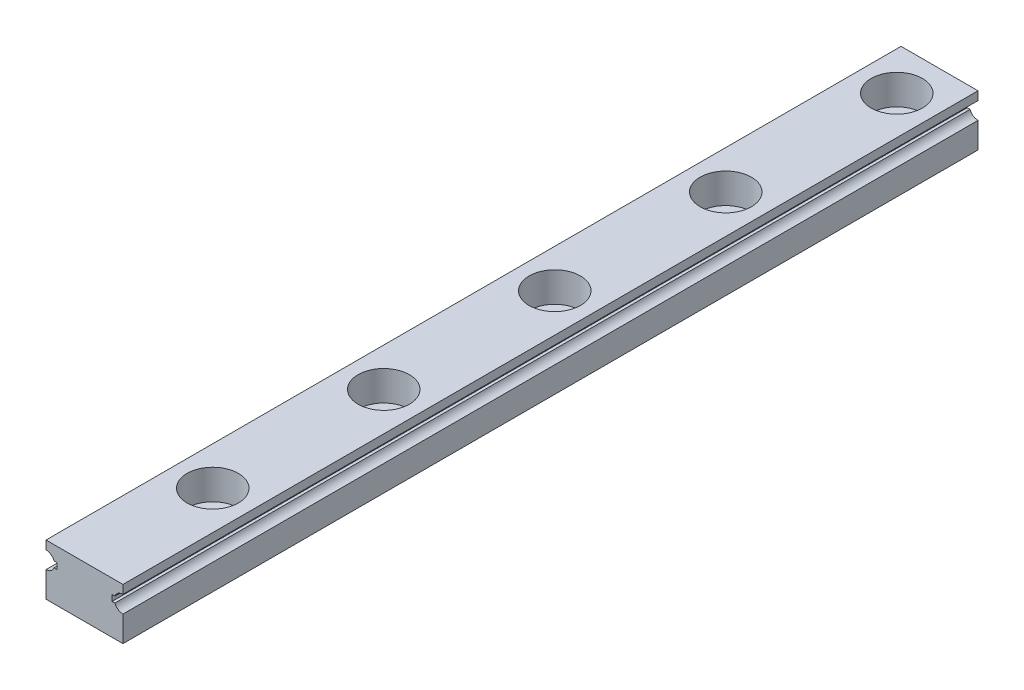
ISO-10303-21;
HEADER;
FILE_DESCRIPTION(('STEP AP214'),'2;1');
FILE_NAME('part.step','',(''),(''),'','','');
FILE_SCHEMA(('AUTOMOTIVE_DESIGN { 1 0 10303 214 1 1 1 1 }'));
ENDSEC;
DATA;
#1=APPLICATION_CONTEXT('core data for automotive mechanical design processes');
#2=APPLICATION_PROTOCOL_DEFINITION('international standard','automotive_design',2000,#1);
#3=PRODUCT_CONTEXT('',#1,'mechanical');
#4=PRODUCT('Part','Part','',(#3));
#5=PRODUCT_RELATED_PRODUCT_CATEGORY('part','',(#4));
#6=PRODUCT_DEFINITION_FORMATION('','',#4);
#7=PRODUCT_DEFINITION_CONTEXT('part definition',#1,'design');
#8=PRODUCT_DEFINITION('design','',#6,#7);
#9=PRODUCT_DEFINITION_SHAPE('','',#8);
#10=(LENGTH_UNIT() NAMED_UNIT(*) SI_UNIT(.MILLI.,.METRE.));
#11=(NAMED_UNIT(*) PLANE_ANGLE_UNIT() SI_UNIT($,.RADIAN.));
#12=(NAMED_UNIT(*) SI_UNIT($,.STERADIAN.) SOLID_ANGLE_UNIT());
#13=UNCERTAINTY_MEASURE_WITH_UNIT(LENGTH_MEASURE(1.E-05),#10,'distance_accuracy_value','');
#14=(GEOMETRIC_REPRESENTATION_CONTEXT(3) GLOBAL_UNCERTAINTY_ASSIGNED_CONTEXT((#13)) GLOBAL_UNIT_ASSIGNED_CONTEXT((#10,
#11,#12)) REPRESENTATION_CONTEXT('',''));
#15=CARTESIAN_POINT('',(0.,0.,0.));
#16=DIRECTION('',(0.,0.,1.));
#17=DIRECTION('',(1.,0.,0.));
#18=AXIS2_PLACEMENT_3D('',#15,#16,#17);
#19=CARTESIAN_POINT('',(4.5,2.,100.));
#20=DIRECTION('',(-1.,0.,0.));
#21=DIRECTION('',(0.,-1.,0.));
#22=AXIS2_PLACEMENT_3D('',#19,#20,#21);
#23=PLANE('',#22);
#24=DIRECTION('',(0.,1.,0.));
#25=VECTOR('',#24,1.);
#26=CARTESIAN_POINT('',(4.5,2.,0.));
#27=LINE('',#26,#25);
#28=CARTESIAN_POINT('',(4.5,2.,0.));
#29=VERTEX_POINT('',#28);
#30=CARTESIAN_POINT('',(4.5,3.,0.));
#31=VERTEX_POINT('',#30);
#32=EDGE_CURVE('E182',#29,#31,#27,.T.);
#33=ORIENTED_EDGE('',*,*,#32,.T.);
#34=DIRECTION('',(0.,0.,-1.));
#35=VECTOR('',#34,1.);
#36=CARTESIAN_POINT('',(4.5,3.,100.));
#37=LINE('',#36,#35);
#38=CARTESIAN_POINT('',(4.5,3.,100.));
#39=VERTEX_POINT('',#38);
#40=EDGE_CURVE('E250',#39,#31,#37,.T.);
#41=ORIENTED_EDGE('',*,*,#40,.F.);
#42=DIRECTION('',(0.,1.,0.));
#43=VECTOR('',#42,1.);
#44=CARTESIAN_POINT('',(4.5,2.,100.));
#45=LINE('',#44,#43);
#46=CARTESIAN_POINT('',(4.5,2.,100.));
#47=VERTEX_POINT('',#46);
#48=EDGE_CURVE('E213',#47,#39,#45,.T.);
#49=ORIENTED_EDGE('',*,*,#48,.F.);
#50=DIRECTION('',(0.,0.,-1.));
#51=VECTOR('',#50,1.);
#52=CARTESIAN_POINT('',(4.5,2.,100.));
#53=LINE('',#52,#51);
#54=EDGE_CURVE('E178',#47,#29,#53,.T.);
#55=ORIENTED_EDGE('',*,*,#54,.T.);
#56=EDGE_LOOP('',(#33,#41,#49,#55));
#57=FACE_BOUND('',#56,.T.);
#58=ADVANCED_FACE('F34',(#57),#23,.F.);
#59=CARTESIAN_POINT('',(-4.5,3.,100.));
#60=DIRECTION('',(0.,-1.,0.));
#61=DIRECTION('',(0.,0.,-1.));
#62=AXIS2_PLACEMENT_3D('',#59,#60,#61);
#63=PLANE('',#62);
#64=CARTESIAN_POINT('',(0.,3.,25.));
#65=DIRECTION('',(0.,1.,0.));
#66=DIRECTION('',(0.,0.,1.));
#67=AXIS2_PLACEMENT_3D('',#64,#65,#66);
#68=CIRCLE('',#67,3.);
#69=CARTESIAN_POINT('',(0.,3.,28.));
#70=VERTEX_POINT('',#69);
#71=EDGE_CURVE('E274',#70,#70,#68,.T.);
#72=ORIENTED_EDGE('',*,*,#71,.F.);
#73=EDGE_LOOP('',(#72));
#74=FACE_BOUND('',#73,.T.);
#75=CARTESIAN_POINT('',(0.,3.,5.));
#76=DIRECTION('',(0.,1.,0.));
#77=DIRECTION('',(0.,0.,1.));
#78=AXIS2_PLACEMENT_3D('',#75,#76,#77);
#79=CIRCLE('',#78,3.);
#80=CARTESIAN_POINT('',(0.,3.,8.));
#81=VERTEX_POINT('',#80);
#82=EDGE_CURVE('E256',#81,#81,#79,.T.);
#83=ORIENTED_EDGE('',*,*,#82,.F.);
#84=EDGE_LOOP('',(#83));
#85=FACE_BOUND('',#84,.T.);
#86=DIRECTION('',(-1.,0.,0.));
#87=VECTOR('',#86,1.);
#88=CARTESIAN_POINT('',(-4.5,3.,0.));
#89=LINE('',#88,#87);
#90=CARTESIAN_POINT('',(-4.5,3.,0.));
#91=VERTEX_POINT('',#90);
#92=EDGE_CURVE('E185',#31,#91,#89,.T.);
#93=ORIENTED_EDGE('',*,*,#92,.T.);
#94=DIRECTION('',(0.,0.,-1.));
#95=VECTOR('',#94,1.);
#96=CARTESIAN_POINT('',(-4.5,3.,100.));
#97=LINE('',#96,#95);
#98=CARTESIAN_POINT('',(-4.5,3.,100.));
#99=VERTEX_POINT('',#98);
#100=EDGE_CURVE('E247',#99,#91,#97,.T.);
#101=ORIENTED_EDGE('',*,*,#100,.F.);
#102=DIRECTION('',(-1.,0.,0.));
#103=VECTOR('',#102,1.);
#104=CARTESIAN_POINT('',(-4.5,3.,100.));
#105=LINE('',#104,#103);
#106=EDGE_CURVE('E121',#39,#99,#105,.T.);
#107=ORIENTED_EDGE('',*,*,#106,.F.);
#108=ORIENTED_EDGE('',*,*,#40,.T.);
#109=EDGE_LOOP('',(#93,#101,#107,#108));
#110=FACE_BOUND('',#109,.T.);
#111=CARTESIAN_POINT('',(0.,3.,45.));
#112=DIRECTION('',(0.,1.,0.));
#113=DIRECTION('',(0.,0.,1.));
#114=AXIS2_PLACEMENT_3D('',#111,#112,#113);
#115=CIRCLE('',#114,3.);
#116=CARTESIAN_POINT('',(0.,3.,48.));
#117=VERTEX_POINT('',#116);
#118=EDGE_CURVE('E252',#117,#117,#115,.T.);
#119=ORIENTED_EDGE('',*,*,#118,.F.);
#120=EDGE_LOOP('',(#119));
#121=FACE_BOUND('',#120,.T.);
#122=CARTESIAN_POINT('',(0.,3.,65.));
#123=DIRECTION('',(0.,1.,0.));
#124=DIRECTION('',(0.,0.,1.));
#125=AXIS2_PLACEMENT_3D('',#122,#123,#124);
#126=CIRCLE('',#125,3.);
#127=CARTESIAN_POINT('',(0.,3.,68.));
#128=VERTEX_POINT('',#127);
#129=EDGE_CURVE('E263',#128,#128,#126,.T.);
#130=ORIENTED_EDGE('',*,*,#129,.F.);
#131=EDGE_LOOP('',(#130));
#132=FACE_BOUND('',#131,.T.);
#133=CARTESIAN_POINT('',(0.,3.,85.));
#134=DIRECTION('',(0.,1.,0.));
#135=DIRECTION('',(0.,0.,1.));
#136=AXIS2_PLACEMENT_3D('',#133,#134,#135);
#137=CIRCLE('',#136,3.);
#138=CARTESIAN_POINT('',(0.,3.,88.));
#139=VERTEX_POINT('',#138);
#140=EDGE_CURVE('E44',#139,#139,#137,.T.);
#141=ORIENTED_EDGE('',*,*,#140,.F.);
#142=EDGE_LOOP('',(#141));
#143=FACE_BOUND('',#142,.T.);
#144=ADVANCED_FACE('F356',(#74,#85,#110,#121,#132,#143),#63,.F.);
#145=CARTESIAN_POINT('',(-4.5,2.,100.));
#146=DIRECTION('',(1.,0.,0.));
#147=DIRECTION('',(0.,1.,0.));
#148=AXIS2_PLACEMENT_3D('',#145,#146,#147);
#149=PLANE('',#148);
#150=DIRECTION('',(0.,-1.,0.));
#151=VECTOR('',#150,1.);
#152=CARTESIAN_POINT('',(-4.5,2.,0.));
#153=LINE('',#152,#151);
#154=CARTESIAN_POINT('',(-4.5,2.,0.));
#155=VERTEX_POINT('',#154);
#156=EDGE_CURVE('E188',#91,#155,#153,.T.);
#157=ORIENTED_EDGE('',*,*,#156,.T.);
#158=DIRECTION('',(0.,0.,-1.));
#159=VECTOR('',#158,1.);
#160=CARTESIAN_POINT('',(-4.5,2.,100.));
#161=LINE('',#160,#159);
#162=CARTESIAN_POINT('',(-4.5,2.,100.));
#163=VERTEX_POINT('',#162);
#164=EDGE_CURVE('E244',#163,#155,#161,.T.);
#165=ORIENTED_EDGE('',*,*,#164,.F.);
#166=DIRECTION('',(0.,-1.,0.));
#167=VECTOR('',#166,1.);
#168=CARTESIAN_POINT('',(-4.5,2.,100.));
#169=LINE('',#168,#167);
#170=EDGE_CURVE('E309',#99,#163,#169,.T.);
#171=ORIENTED_EDGE('',*,*,#170,.F.);
#172=ORIENTED_EDGE('',*,*,#100,.T.);
#173=EDGE_LOOP('',(#157,#165,#171,#172));
#174=FACE_BOUND('',#173,.T.);
#175=ADVANCED_FACE('F361',(#174),#149,.F.);
#176=CARTESIAN_POINT('',(-4.5,1.,100.));
#177=DIRECTION('',(0.,0.,-1.));
#178=DIRECTION('',(-1.,0.,0.));
#179=AXIS2_PLACEMENT_3D('',#176,#177,#178);
#180=CYLINDRICAL_SURFACE('',#179,1.);
#181=CARTESIAN_POINT('',(-4.5,1.,0.));
#182=DIRECTION('',(0.,0.,-1.));
#183=DIRECTION('',(1.,0.,0.));
#184=AXIS2_PLACEMENT_3D('',#181,#182,#183);
#185=CIRCLE('',#184,1.);
#186=CARTESIAN_POINT('',(-3.56399113733362,1.35197643246386,0.));
#187=VERTEX_POINT('',#186);
#188=EDGE_CURVE('E190',#155,#187,#185,.T.);
#189=ORIENTED_EDGE('',*,*,#188,.T.);
#190=DIRECTION('',(0.,0.,-1.));
#191=VECTOR('',#190,1.);
#192=CARTESIAN_POINT('',(-3.56399113733362,1.35197643246386,100.));
#193=LINE('',#192,#191);
#194=CARTESIAN_POINT('',(-3.56399113733362,1.35197643246386,100.));
#195=VERTEX_POINT('',#194);
#196=EDGE_CURVE('E241',#195,#187,#193,.T.);
#197=ORIENTED_EDGE('',*,*,#196,.F.);
#198=CARTESIAN_POINT('',(-4.5,1.,100.));
#199=DIRECTION('',(0.,0.,-1.));
#200=DIRECTION('',(1.,0.,0.));
#201=AXIS2_PLACEMENT_3D('',#198,#199,#200);
#202=CIRCLE('',#201,1.);
#203=EDGE_CURVE('E311',#163,#195,#202,.T.);
#204=ORIENTED_EDGE('',*,*,#203,.F.);
#205=ORIENTED_EDGE('',*,*,#164,.T.);
#206=EDGE_LOOP('',(#189,#197,#204,#205));
#207=FACE_BOUND('',#206,.T.);
#208=ADVANCED_FACE('F456',(#207),#180,.F.);
#209=CARTESIAN_POINT('',(-3.56399113733362,1.35197643246386,100.));
#210=DIRECTION('',(0.,1.,0.));
#211=DIRECTION('',(0.,0.,1.));
#212=AXIS2_PLACEMENT_3D('',#209,#210,#211);
#213=PLANE('',#212);
#214=DIRECTION('',(1.,0.,0.));
#215=VECTOR('',#214,1.);
#216=CARTESIAN_POINT('',(-3.56399113733362,1.35197643246386,0.));
#217=LINE('',#216,#215);
#218=CARTESIAN_POINT('',(-3.23507302495561,1.35197643246386,0.));
#219=VERTEX_POINT('',#218);
#220=EDGE_CURVE('E192',#187,#219,#217,.T.);
#221=ORIENTED_EDGE('',*,*,#220,.T.);
#222=DIRECTION('',(0.,0.,-1.));
#223=VECTOR('',#222,1.);
#224=CARTESIAN_POINT('',(-3.23507302495561,1.35197643246386,100.));
#225=LINE('',#224,#223);
#226=CARTESIAN_POINT('',(-3.23507302495561,1.35197643246386,100.));
#227=VERTEX_POINT('',#226);
#228=EDGE_CURVE('E238',#227,#219,#225,.T.);
#229=ORIENTED_EDGE('',*,*,#228,.F.);
#230=DIRECTION('',(1.,0.,0.));
#231=VECTOR('',#230,1.);
#232=CARTESIAN_POINT('',(-3.56399113733362,1.35197643246386,100.));
#233=LINE('',#232,#231);
#234=EDGE_CURVE('E313',#195,#227,#233,.T.);
#235=ORIENTED_EDGE('',*,*,#234,.F.);
#236=ORIENTED_EDGE('',*,*,#196,.T.);
#237=EDGE_LOOP('',(#221,#229,#235,#236));
#238=FACE_BOUND('',#237,.T.);
#239=ADVANCED_FACE('F452',(#238),#213,.F.);
#240=CARTESIAN_POINT('',(-3.23507302495561,0.648023567536147,100.));
#241=DIRECTION('',(1.,0.,0.));
#242=DIRECTION('',(0.,0.,-1.));
#243=AXIS2_PLACEMENT_3D('',#240,#241,#242);
#244=PLANE('',#243);
#245=DIRECTION('',(0.,-1.,0.));
#246=VECTOR('',#245,1.);
#247=CARTESIAN_POINT('',(-3.23507302495561,0.648023567536147,0.));
#248=LINE('',#247,#246);
#249=CARTESIAN_POINT('',(-3.23507302495561,0.648023567536147,0.));
#250=VERTEX_POINT('',#249);
#251=EDGE_CURVE('E194',#219,#250,#248,.T.);
#252=ORIENTED_EDGE('',*,*,#251,.T.);
#253=DIRECTION('',(0.,0.,-1.));
#254=VECTOR('',#253,1.);
#255=CARTESIAN_POINT('',(-3.23507302495561,0.648023567536147,100.));
#256=LINE('',#255,#254);
#257=CARTESIAN_POINT('',(-3.23507302495561,0.648023567536147,100.));
#258=VERTEX_POINT('',#257);
#259=EDGE_CURVE('E235',#258,#250,#256,.T.);
#260=ORIENTED_EDGE('',*,*,#259,.F.);
#261=DIRECTION('',(0.,-1.,0.));
#262=VECTOR('',#261,1.);
#263=CARTESIAN_POINT('',(-3.23507302495561,0.648023567536147,100.));
#264=LINE('',#263,#262);
#265=EDGE_CURVE('E315',#227,#258,#264,.T.);
#266=ORIENTED_EDGE('',*,*,#265,.F.);
#267=ORIENTED_EDGE('',*,*,#228,.T.);
#268=EDGE_LOOP('',(#252,#260,#266,#267));
#269=FACE_BOUND('',#268,.T.);
#270=ADVANCED_FACE('F448',(#269),#244,.F.);
#271=CARTESIAN_POINT('',(-3.56399113733362,0.648023567536147,100.));
#272=DIRECTION('',(0.,-1.,0.));
#273=DIRECTION('',(0.,0.,-1.));
#274=AXIS2_PLACEMENT_3D('',#271,#272,#273);
#275=PLANE('',#274);
#276=DIRECTION('',(-1.,0.,0.));
#277=VECTOR('',#276,1.);
#278=CARTESIAN_POINT('',(-3.56399113733362,0.648023567536147,0.));
#279=LINE('',#278,#277);
#280=CARTESIAN_POINT('',(-3.56399113733362,0.648023567536147,0.));
#281=VERTEX_POINT('',#280);
#282=EDGE_CURVE('E196',#250,#281,#279,.T.);
#283=ORIENTED_EDGE('',*,*,#282,.T.);
#284=DIRECTION('',(0.,0.,-1.));
#285=VECTOR('',#284,1.);
#286=CARTESIAN_POINT('',(-3.56399113733362,0.648023567536147,100.));
#287=LINE('',#286,#285);
#288=CARTESIAN_POINT('',(-3.56399113733362,0.648023567536147,100.));
#289=VERTEX_POINT('',#288);
#290=EDGE_CURVE('E232',#289,#281,#287,.T.);
#291=ORIENTED_EDGE('',*,*,#290,.F.);
#292=DIRECTION('',(-1.,0.,0.));
#293=VECTOR('',#292,1.);
#294=CARTESIAN_POINT('',(-3.56399113733362,0.648023567536147,100.));
#295=LINE('',#294,#293);
#296=EDGE_CURVE('E317',#258,#289,#295,.T.);
#297=ORIENTED_EDGE('',*,*,#296,.F.);
#298=ORIENTED_EDGE('',*,*,#259,.T.);
#299=EDGE_LOOP('',(#283,#291,#297,#298));
#300=FACE_BOUND('',#299,.T.);
#301=ADVANCED_FACE('F444',(#300),#275,.F.);
#302=CARTESIAN_POINT('',(-4.5,1.,100.));
#303=DIRECTION('',(0.,0.,-1.));
#304=DIRECTION('',(-1.,0.,0.));
#305=AXIS2_PLACEMENT_3D('',#302,#303,#304);
#306=CYLINDRICAL_SURFACE('',#305,1.);
#307=CARTESIAN_POINT('',(-4.5,1.,0.));
#308=DIRECTION('',(0.,0.,-1.));
#309=DIRECTION('',(1.,0.,0.));
#310=AXIS2_PLACEMENT_3D('',#307,#308,#309);
#311=CIRCLE('',#310,1.);
#312=CARTESIAN_POINT('',(-4.5,0.,0.));
#313=VERTEX_POINT('',#312);
#314=EDGE_CURVE('E198',#281,#313,#311,.T.);
#315=ORIENTED_EDGE('',*,*,#314,.T.);
#316=DIRECTION('',(0.,0.,-1.));
#317=VECTOR('',#316,1.);
#318=CARTESIAN_POINT('',(-4.5,0.,100.));
#319=LINE('',#318,#317);
#320=CARTESIAN_POINT('',(-4.5,0.,100.));
#321=VERTEX_POINT('',#320);
#322=EDGE_CURVE('E229',#321,#313,#319,.T.);
#323=ORIENTED_EDGE('',*,*,#322,.F.);
#324=CARTESIAN_POINT('',(-4.5,1.,100.));
#325=DIRECTION('',(0.,0.,-1.));
#326=DIRECTION('',(1.,0.,0.));
#327=AXIS2_PLACEMENT_3D('',#324,#325,#326);
#328=CIRCLE('',#327,1.);
#329=EDGE_CURVE('E319',#289,#321,#328,.T.);
#330=ORIENTED_EDGE('',*,*,#329,.F.);
#331=ORIENTED_EDGE('',*,*,#290,.T.);
#332=EDGE_LOOP('',(#315,#323,#330,#331));
#333=FACE_BOUND('',#332,.T.);
#334=ADVANCED_FACE('F440',(#333),#306,.F.);
#335=CARTESIAN_POINT('',(-4.5,-3.,100.));
#336=DIRECTION('',(1.,0.,0.));
#337=DIRECTION('',(0.,0.,-1.));
#338=AXIS2_PLACEMENT_3D('',#335,#336,#337);
#339=PLANE('',#338);
#340=DIRECTION('',(0.,-1.,0.));
#341=VECTOR('',#340,1.);
#342=CARTESIAN_POINT('',(-4.5,-3.,0.));
#343=LINE('',#342,#341);
#344=CARTESIAN_POINT('',(-4.5,-3.,0.));
#345=VERTEX_POINT('',#344);
#346=EDGE_CURVE('E200',#313,#345,#343,.T.);
#347=ORIENTED_EDGE('',*,*,#346,.T.);
#348=DIRECTION('',(0.,0.,-1.));
#349=VECTOR('',#348,1.);
#350=CARTESIAN_POINT('',(-4.5,-3.,100.));
#351=LINE('',#350,#349);
#352=CARTESIAN_POINT('',(-4.5,-3.,100.));
#353=VERTEX_POINT('',#352);
#354=EDGE_CURVE('E226',#353,#345,#351,.T.);
#355=ORIENTED_EDGE('',*,*,#354,.F.);
#356=DIRECTION('',(0.,-1.,0.));
#357=VECTOR('',#356,1.);
#358=CARTESIAN_POINT('',(-4.5,-3.,100.));
#359=LINE('',#358,#357);
#360=EDGE_CURVE('E321',#321,#353,#359,.T.);
#361=ORIENTED_EDGE('',*,*,#360,.F.);
#362=ORIENTED_EDGE('',*,*,#322,.T.);
#363=EDGE_LOOP('',(#347,#355,#361,#362));
#364=FACE_BOUND('',#363,.T.);
#365=ADVANCED_FACE('F414',(#364),#339,.F.);
#366=CARTESIAN_POINT('',(-4.5,-3.,100.));
#367=DIRECTION('',(0.,1.,0.));
#368=DIRECTION('',(-1.,0.,0.));
#369=AXIS2_PLACEMENT_3D('',#366,#367,#368);
#370=PLANE('',#369);
#371=CARTESIAN_POINT('',(0.,-3.,85.));
#372=DIRECTION('',(0.,1.,0.));
#373=DIRECTION('',(0.,0.,1.));
#374=AXIS2_PLACEMENT_3D('',#371,#372,#373);
#375=CIRCLE('',#374,1.75);
#376=CARTESIAN_POINT('',(0.,-3.,86.75));
#377=VERTEX_POINT('',#376);
#378=EDGE_CURVE('E291',#377,#377,#375,.T.);
#379=ORIENTED_EDGE('',*,*,#378,.T.);
#380=EDGE_LOOP('',(#379));
#381=FACE_BOUND('',#380,.T.);
#382=CARTESIAN_POINT('',(0.,-3.,65.));
#383=DIRECTION('',(0.,1.,0.));
#384=DIRECTION('',(0.,0.,1.));
#385=AXIS2_PLACEMENT_3D('',#382,#383,#384);
#386=CIRCLE('',#385,1.75);
#387=CARTESIAN_POINT('',(0.,-3.,66.75));
#388=VERTEX_POINT('',#387);
#389=EDGE_CURVE('E281',#388,#388,#386,.T.);
#390=ORIENTED_EDGE('',*,*,#389,.T.);
#391=EDGE_LOOP('',(#390));
#392=FACE_BOUND('',#391,.T.);
#393=CARTESIAN_POINT('',(0.,-3.,45.));
#394=DIRECTION('',(0.,1.,0.));
#395=DIRECTION('',(0.,0.,1.));
#396=AXIS2_PLACEMENT_3D('',#393,#394,#395);
#397=CIRCLE('',#396,1.75);
#398=CARTESIAN_POINT('',(0.,-3.,46.75));
#399=VERTEX_POINT('',#398);
#400=EDGE_CURVE('E278',#399,#399,#397,.T.);
#401=ORIENTED_EDGE('',*,*,#400,.T.);
#402=EDGE_LOOP('',(#401));
#403=FACE_BOUND('',#402,.T.);
#404=CARTESIAN_POINT('',(0.,-3.,25.));
#405=DIRECTION('',(0.,1.,0.));
#406=DIRECTION('',(0.,0.,1.));
#407=AXIS2_PLACEMENT_3D('',#404,#405,#406);
#408=CIRCLE('',#407,1.75);
#409=CARTESIAN_POINT('',(0.,-3.,26.75));
#410=VERTEX_POINT('',#409);
#411=EDGE_CURVE('E275',#410,#410,#408,.T.);
#412=ORIENTED_EDGE('',*,*,#411,.T.);
#413=EDGE_LOOP('',(#412));
#414=FACE_BOUND('',#413,.T.);
#415=CARTESIAN_POINT('',(0.,-3.,5.));
#416=DIRECTION('',(0.,1.,0.));
#417=DIRECTION('',(0.,0.,1.));
#418=AXIS2_PLACEMENT_3D('',#415,#416,#417);
#419=CIRCLE('',#418,1.75);
#420=CARTESIAN_POINT('',(0.,-3.,6.75));
#421=VERTEX_POINT('',#420);
#422=EDGE_CURVE('E257',#421,#421,#419,.T.);
#423=ORIENTED_EDGE('',*,*,#422,.T.);
#424=EDGE_LOOP('',(#423));
#425=FACE_BOUND('',#424,.T.);
#426=DIRECTION('',(1.,0.,0.));
#427=VECTOR('',#426,1.);
#428=CARTESIAN_POINT('',(-4.5,-3.,0.));
#429=LINE('',#428,#427);
#430=CARTESIAN_POINT('',(4.5,-3.,0.));
#431=VERTEX_POINT('',#430);
#432=EDGE_CURVE('E202',#345,#431,#429,.T.);
#433=ORIENTED_EDGE('',*,*,#432,.T.);
#434=DIRECTION('',(0.,0.,-1.));
#435=VECTOR('',#434,1.);
#436=CARTESIAN_POINT('',(4.5,-3.,100.));
#437=LINE('',#436,#435);
#438=CARTESIAN_POINT('',(4.5,-3.,100.));
#439=VERTEX_POINT('',#438);
#440=EDGE_CURVE('E223',#439,#431,#437,.T.);
#441=ORIENTED_EDGE('',*,*,#440,.F.);
#442=DIRECTION('',(1.,0.,0.));
#443=VECTOR('',#442,1.);
#444=CARTESIAN_POINT('',(-4.5,-3.,100.));
#445=LINE('',#444,#443);
#446=EDGE_CURVE('E323',#353,#439,#445,.T.);
#447=ORIENTED_EDGE('',*,*,#446,.F.);
#448=ORIENTED_EDGE('',*,*,#354,.T.);
#449=EDGE_LOOP('',(#433,#441,#447,#448));
#450=FACE_BOUND('',#449,.T.);
#451=ADVANCED_FACE('F411',(#381,#392,#403,#414,#425,#450),#370,.F.);
#452=CARTESIAN_POINT('',(4.5,-3.,100.));
#453=DIRECTION('',(-1.,0.,0.));
#454=DIRECTION('',(0.,-1.,0.));
#455=AXIS2_PLACEMENT_3D('',#452,#453,#454);
#456=PLANE('',#455);
#457=DIRECTION('',(0.,1.,0.));
#458=VECTOR('',#457,1.);
#459=CARTESIAN_POINT('',(4.5,-3.,0.));
#460=LINE('',#459,#458);
#461=CARTESIAN_POINT('',(4.5,0.,0.));
#462=VERTEX_POINT('',#461);
#463=EDGE_CURVE('E204',#431,#462,#460,.T.);
#464=ORIENTED_EDGE('',*,*,#463,.T.);
#465=DIRECTION('',(0.,0.,-1.));
#466=VECTOR('',#465,1.);
#467=CARTESIAN_POINT('',(4.5,0.,100.));
#468=LINE('',#467,#466);
#469=CARTESIAN_POINT('',(4.5,0.,100.));
#470=VERTEX_POINT('',#469);
#471=EDGE_CURVE('E220',#470,#462,#468,.T.);
#472=ORIENTED_EDGE('',*,*,#471,.F.);
#473=DIRECTION('',(0.,1.,0.));
#474=VECTOR('',#473,1.);
#475=CARTESIAN_POINT('',(4.5,-3.,100.));
#476=LINE('',#475,#474);
#477=EDGE_CURVE('E325',#439,#470,#476,.T.);
#478=ORIENTED_EDGE('',*,*,#477,.F.);
#479=ORIENTED_EDGE('',*,*,#440,.T.);
#480=EDGE_LOOP('',(#464,#472,#478,#479));
#481=FACE_BOUND('',#480,.T.);
#482=ADVANCED_FACE('F413',(#481),#456,.F.);
#483=CARTESIAN_POINT('',(4.5,1.,100.));
#484=DIRECTION('',(0.,0.,-1.));
#485=DIRECTION('',(-1.,0.,0.));
#486=AXIS2_PLACEMENT_3D('',#483,#484,#485);
#487=CYLINDRICAL_SURFACE('',#486,1.);
#488=CARTESIAN_POINT('',(4.5,1.,0.));
#489=DIRECTION('',(0.,0.,-1.));
#490=DIRECTION('',(-1.,0.,0.));
#491=AXIS2_PLACEMENT_3D('',#488,#489,#490);
#492=CIRCLE('',#491,1.);
#493=CARTESIAN_POINT('',(3.56399113733362,0.648023567536147,0.));
#494=VERTEX_POINT('',#493);
#495=EDGE_CURVE('E206',#462,#494,#492,.T.);
#496=ORIENTED_EDGE('',*,*,#495,.T.);
#497=DIRECTION('',(0.,0.,-1.));
#498=VECTOR('',#497,1.);
#499=CARTESIAN_POINT('',(3.56399113733362,0.648023567536147,100.));
#500=LINE('',#499,#498);
#501=CARTESIAN_POINT('',(3.56399113733362,0.648023567536147,100.));
#502=VERTEX_POINT('',#501);
#503=EDGE_CURVE('E217',#502,#494,#500,.T.);
#504=ORIENTED_EDGE('',*,*,#503,.F.);
#505=CARTESIAN_POINT('',(4.5,1.,100.));
#506=DIRECTION('',(0.,0.,-1.));
#507=DIRECTION('',(-1.,0.,0.));
#508=AXIS2_PLACEMENT_3D('',#505,#506,#507);
#509=CIRCLE('',#508,1.);
#510=EDGE_CURVE('E327',#470,#502,#509,.T.);
#511=ORIENTED_EDGE('',*,*,#510,.F.);
#512=ORIENTED_EDGE('',*,*,#471,.T.);
#513=EDGE_LOOP('',(#496,#504,#511,#512));
#514=FACE_BOUND('',#513,.T.);
#515=ADVANCED_FACE('F333',(#514),#487,.F.);
#516=CARTESIAN_POINT('',(3.56399113733362,0.648023567536147,100.));
#517=DIRECTION('',(0.,-1.,0.));
#518=DIRECTION('',(0.,0.,-1.));
#519=AXIS2_PLACEMENT_3D('',#516,#517,#518);
#520=PLANE('',#519);
#521=DIRECTION('',(-1.,0.,0.));
#522=VECTOR('',#521,1.);
#523=CARTESIAN_POINT('',(3.56399113733362,0.648023567536147,0.));
#524=LINE('',#523,#522);
#525=CARTESIAN_POINT('',(3.23507302495561,0.648023567536147,0.));
#526=VERTEX_POINT('',#525);
#527=EDGE_CURVE('E208',#494,#526,#524,.T.);
#528=ORIENTED_EDGE('',*,*,#527,.T.);
#529=DIRECTION('',(0.,0.,-1.));
#530=VECTOR('',#529,1.);
#531=CARTESIAN_POINT('',(3.23507302495561,0.648023567536147,100.));
#532=LINE('',#531,#530);
#533=CARTESIAN_POINT('',(3.23507302495561,0.648023567536147,100.));
#534=VERTEX_POINT('',#533);
#535=EDGE_CURVE('E173',#534,#526,#532,.T.);
#536=ORIENTED_EDGE('',*,*,#535,.F.);
#537=DIRECTION('',(-1.,0.,0.));
#538=VECTOR('',#537,1.);
#539=CARTESIAN_POINT('',(3.56399113733362,0.648023567536147,100.));
#540=LINE('',#539,#538);
#541=EDGE_CURVE('E164',#502,#534,#540,.T.);
#542=ORIENTED_EDGE('',*,*,#541,.F.);
#543=ORIENTED_EDGE('',*,*,#503,.T.);
#544=EDGE_LOOP('',(#528,#536,#542,#543));
#545=FACE_BOUND('',#544,.T.);
#546=ADVANCED_FACE('F337',(#545),#520,.F.);
#547=CARTESIAN_POINT('',(3.23507302495561,0.648023567536147,100.));
#548=DIRECTION('',(-1.,0.,0.));
#549=DIRECTION('',(0.,0.,1.));
#550=AXIS2_PLACEMENT_3D('',#547,#548,#549);
#551=PLANE('',#550);
#552=DIRECTION('',(0.,1.,0.));
#553=VECTOR('',#552,1.);
#554=CARTESIAN_POINT('',(3.23507302495561,0.648023567536147,0.));
#555=LINE('',#554,#553);
#556=CARTESIAN_POINT('',(3.23507302495561,1.35197643246386,0.));
#557=VERTEX_POINT('',#556);
#558=EDGE_CURVE('E172',#526,#557,#555,.T.);
#559=ORIENTED_EDGE('',*,*,#558,.T.);
#560=DIRECTION('',(0.,0.,-1.));
#561=VECTOR('',#560,1.);
#562=CARTESIAN_POINT('',(3.23507302495561,1.35197643246386,100.));
#563=LINE('',#562,#561);
#564=CARTESIAN_POINT('',(3.23507302495561,1.35197643246386,100.));
#565=VERTEX_POINT('',#564);
#566=EDGE_CURVE('E169',#565,#557,#563,.T.);
#567=ORIENTED_EDGE('',*,*,#566,.F.);
#568=DIRECTION('',(0.,1.,0.));
#569=VECTOR('',#568,1.);
#570=CARTESIAN_POINT('',(3.23507302495561,0.648023567536147,100.));
#571=LINE('',#570,#569);
#572=EDGE_CURVE('E158',#534,#565,#571,.T.);
#573=ORIENTED_EDGE('',*,*,#572,.F.);
#574=ORIENTED_EDGE('',*,*,#535,.T.);
#575=EDGE_LOOP('',(#559,#567,#573,#574));
#576=FACE_BOUND('',#575,.T.);
#577=ADVANCED_FACE('F170',(#576),#551,.F.);
#578=CARTESIAN_POINT('',(3.56399113733362,1.35197643246386,100.));
#579=DIRECTION('',(0.,1.,0.));
#580=DIRECTION('',(0.,0.,1.));
#581=AXIS2_PLACEMENT_3D('',#578,#579,#580);
#582=PLANE('',#581);
#583=DIRECTION('',(1.,0.,0.));
#584=VECTOR('',#583,1.);
#585=CARTESIAN_POINT('',(3.56399113733362,1.35197643246386,0.));
#586=LINE('',#585,#584);
#587=CARTESIAN_POINT('',(3.56399113733362,1.35197643246386,0.));
#588=VERTEX_POINT('',#587);
#589=EDGE_CURVE('E106',#557,#588,#586,.T.);
#590=ORIENTED_EDGE('',*,*,#589,.T.);
#591=DIRECTION('',(0.,0.,-1.));
#592=VECTOR('',#591,1.);
#593=CARTESIAN_POINT('',(3.56399113733362,1.35197643246386,100.));
#594=LINE('',#593,#592);
#595=CARTESIAN_POINT('',(3.56399113733362,1.35197643246386,100.));
#596=VERTEX_POINT('',#595);
#597=EDGE_CURVE('E174',#596,#588,#594,.T.);
#598=ORIENTED_EDGE('',*,*,#597,.F.);
#599=DIRECTION('',(1.,0.,0.));
#600=VECTOR('',#599,1.);
#601=CARTESIAN_POINT('',(3.56399113733362,1.35197643246386,100.));
#602=LINE('',#601,#600);
#603=EDGE_CURVE('E162',#565,#596,#602,.T.);
#604=ORIENTED_EDGE('',*,*,#603,.F.);
#605=ORIENTED_EDGE('',*,*,#566,.T.);
#606=EDGE_LOOP('',(#590,#598,#604,#605));
#607=FACE_BOUND('',#606,.T.);
#608=ADVANCED_FACE('F176',(#607),#582,.F.);
#609=CARTESIAN_POINT('',(4.5,1.,100.));
#610=DIRECTION('',(0.,0.,-1.));
#611=DIRECTION('',(-1.,0.,0.));
#612=AXIS2_PLACEMENT_3D('',#609,#610,#611);
#613=CYLINDRICAL_SURFACE('',#612,1.);
#614=CARTESIAN_POINT('',(4.5,1.,0.));
#615=DIRECTION('',(0.,0.,-1.));
#616=DIRECTION('',(-1.,0.,0.));
#617=AXIS2_PLACEMENT_3D('',#614,#615,#616);
#618=CIRCLE('',#617,1.);
#619=EDGE_CURVE('E112',#588,#29,#618,.T.);
#620=ORIENTED_EDGE('',*,*,#619,.T.);
#621=ORIENTED_EDGE('',*,*,#54,.F.);
#622=CARTESIAN_POINT('',(4.5,1.,100.));
#623=DIRECTION('',(0.,0.,-1.));
#624=DIRECTION('',(-1.,0.,0.));
#625=AXIS2_PLACEMENT_3D('',#622,#623,#624);
#626=CIRCLE('',#625,1.);
#627=EDGE_CURVE('E53',#596,#47,#626,.T.);
#628=ORIENTED_EDGE('',*,*,#627,.F.);
#629=ORIENTED_EDGE('',*,*,#597,.T.);
#630=EDGE_LOOP('',(#620,#621,#628,#629));
#631=FACE_BOUND('',#630,.T.);
#632=ADVANCED_FACE('F345',(#631),#613,.F.);
#633=CARTESIAN_POINT('',(-4.5,1.,100.));
#634=DIRECTION('',(0.,0.,1.));
#635=DIRECTION('',(1.,0.,0.));
#636=AXIS2_PLACEMENT_3D('',#633,#634,#635);
#637=PLANE('',#636);
#638=ORIENTED_EDGE('',*,*,#48,.T.);
#639=ORIENTED_EDGE('',*,*,#106,.T.);
#640=ORIENTED_EDGE('',*,*,#170,.T.);
#641=ORIENTED_EDGE('',*,*,#203,.T.);
#642=ORIENTED_EDGE('',*,*,#234,.T.);
#643=ORIENTED_EDGE('',*,*,#265,.T.);
#644=ORIENTED_EDGE('',*,*,#296,.T.);
#645=ORIENTED_EDGE('',*,*,#329,.T.);
#646=ORIENTED_EDGE('',*,*,#360,.T.);
#647=ORIENTED_EDGE('',*,*,#446,.T.);
#648=ORIENTED_EDGE('',*,*,#477,.T.);
#649=ORIENTED_EDGE('',*,*,#510,.T.);
#650=ORIENTED_EDGE('',*,*,#541,.T.);
#651=ORIENTED_EDGE('',*,*,#572,.T.);
#652=ORIENTED_EDGE('',*,*,#603,.T.);
#653=ORIENTED_EDGE('',*,*,#627,.T.);
#654=EDGE_LOOP('',(#638,#639,#640,#641,#642,#643,#644,#645,#646,#647,#648,#649,#650,#651,#652,#653));
#655=FACE_BOUND('',#654,.T.);
#656=ADVANCED_FACE('F160',(#655),#637,.T.);
#657=CARTESIAN_POINT('',(-4.5,1.,0.));
#658=DIRECTION('',(0.,0.,1.));
#659=DIRECTION('',(1.,0.,0.));
#660=AXIS2_PLACEMENT_3D('',#657,#658,#659);
#661=PLANE('',#660);
#662=ORIENTED_EDGE('',*,*,#32,.F.);
#663=ORIENTED_EDGE('',*,*,#619,.F.);
#664=ORIENTED_EDGE('',*,*,#589,.F.);
#665=ORIENTED_EDGE('',*,*,#558,.F.);
#666=ORIENTED_EDGE('',*,*,#527,.F.);
#667=ORIENTED_EDGE('',*,*,#495,.F.);
#668=ORIENTED_EDGE('',*,*,#463,.F.);
#669=ORIENTED_EDGE('',*,*,#432,.F.);
#670=ORIENTED_EDGE('',*,*,#346,.F.);
#671=ORIENTED_EDGE('',*,*,#314,.F.);
#672=ORIENTED_EDGE('',*,*,#282,.F.);
#673=ORIENTED_EDGE('',*,*,#251,.F.);
#674=ORIENTED_EDGE('',*,*,#220,.F.);
#675=ORIENTED_EDGE('',*,*,#188,.F.);
#676=ORIENTED_EDGE('',*,*,#156,.F.);
#677=ORIENTED_EDGE('',*,*,#92,.F.);
#678=EDGE_LOOP('',(#662,#663,#664,#665,#666,#667,#668,#669,#670,#671,#672,#673,#674,#675,#676,#677));
#679=FACE_BOUND('',#678,.T.);
#680=ADVANCED_FACE('F340',(#679),#661,.F.);
#681=CARTESIAN_POINT('',(0.,-0.499999999999999,5.));
#682=DIRECTION('',(0.,1.,0.));
#683=DIRECTION('',(0.,0.,1.));
#684=AXIS2_PLACEMENT_3D('',#681,#682,#683);
#685=CYLINDRICAL_SURFACE('',#684,3.);
#686=CARTESIAN_POINT('',(0.,-0.499999999999999,5.));
#687=DIRECTION('',(0.,1.,0.));
#688=DIRECTION('',(0.,0.,1.));
#689=AXIS2_PLACEMENT_3D('',#686,#687,#688);
#690=CIRCLE('',#689,3.);
#691=CARTESIAN_POINT('',(0.,-0.499999999999999,8.));
#692=VERTEX_POINT('',#691);
#693=EDGE_CURVE('E186',#692,#692,#690,.T.);
#694=ORIENTED_EDGE('',*,*,#693,.F.);
#695=EDGE_LOOP('',(#694));
#696=FACE_BOUND('',#695,.T.);
#697=ORIENTED_EDGE('',*,*,#82,.T.);
#698=EDGE_LOOP('',(#697));
#699=FACE_BOUND('',#698,.T.);
#700=ADVANCED_FACE('F616',(#696,#699),#685,.F.);
#701=CARTESIAN_POINT('',(0.,-0.499999999999999,5.));
#702=DIRECTION('',(0.,1.,0.));
#703=DIRECTION('',(0.,0.,1.));
#704=AXIS2_PLACEMENT_3D('',#701,#702,#703);
#705=PLANE('',#704);
#706=CARTESIAN_POINT('',(0.,-0.499999999999999,5.));
#707=DIRECTION('',(0.,1.,0.));
#708=DIRECTION('',(0.,0.,1.));
#709=AXIS2_PLACEMENT_3D('',#706,#707,#708);
#710=CIRCLE('',#709,1.75);
#711=CARTESIAN_POINT('',(0.,-0.499999999999999,6.75));
#712=VERTEX_POINT('',#711);
#713=EDGE_CURVE('E253',#712,#712,#710,.T.);
#714=ORIENTED_EDGE('',*,*,#713,.F.);
#715=EDGE_LOOP('',(#714));
#716=FACE_BOUND('',#715,.T.);
#717=ORIENTED_EDGE('',*,*,#693,.T.);
#718=EDGE_LOOP('',(#717));
#719=FACE_BOUND('',#718,.T.);
#720=ADVANCED_FACE('F612',(#716,#719),#705,.T.);
#721=CARTESIAN_POINT('',(0.,-3.,5.));
#722=DIRECTION('',(0.,1.,0.));
#723=DIRECTION('',(0.,0.,1.));
#724=AXIS2_PLACEMENT_3D('',#721,#722,#723);
#725=CYLINDRICAL_SURFACE('',#724,1.75);
#726=ORIENTED_EDGE('',*,*,#713,.T.);
#727=EDGE_LOOP('',(#726));
#728=FACE_BOUND('',#727,.T.);
#729=ORIENTED_EDGE('',*,*,#422,.F.);
#730=EDGE_LOOP('',(#729));
#731=FACE_BOUND('',#730,.T.);
#732=ADVANCED_FACE('F532',(#728,#731),#725,.F.);
#733=CARTESIAN_POINT('',(0.,-0.499999999999999,25.));
#734=DIRECTION('',(0.,1.,0.));
#735=DIRECTION('',(0.,0.,1.));
#736=AXIS2_PLACEMENT_3D('',#733,#734,#735);
#737=CYLINDRICAL_SURFACE('',#736,3.);
#738=CARTESIAN_POINT('',(0.,-0.499999999999999,25.));
#739=DIRECTION('',(0.,1.,0.));
#740=DIRECTION('',(0.,0.,1.));
#741=AXIS2_PLACEMENT_3D('',#738,#739,#740);
#742=CIRCLE('',#741,3.);
#743=CARTESIAN_POINT('',(0.,-0.499999999999999,28.));
#744=VERTEX_POINT('',#743);
#745=EDGE_CURVE('E298',#744,#744,#742,.T.);
#746=ORIENTED_EDGE('',*,*,#745,.F.);
#747=EDGE_LOOP('',(#746));
#748=FACE_BOUND('',#747,.T.);
#749=ORIENTED_EDGE('',*,*,#71,.T.);
#750=EDGE_LOOP('',(#749));
#751=FACE_BOUND('',#750,.T.);
#752=ADVANCED_FACE('F527',(#748,#751),#737,.F.);
#753=CARTESIAN_POINT('',(0.,-0.499999999999999,25.));
#754=DIRECTION('',(0.,1.,0.));
#755=DIRECTION('',(0.,0.,1.));
#756=AXIS2_PLACEMENT_3D('',#753,#754,#755);
#757=PLANE('',#756);
#758=CARTESIAN_POINT('',(0.,-0.499999999999999,25.));
#759=DIRECTION('',(0.,1.,0.));
#760=DIRECTION('',(0.,0.,1.));
#761=AXIS2_PLACEMENT_3D('',#758,#759,#760);
#762=CIRCLE('',#761,1.75);
#763=CARTESIAN_POINT('',(0.,-0.499999999999999,26.75));
#764=VERTEX_POINT('',#763);
#765=EDGE_CURVE('E271',#764,#764,#762,.T.);
#766=ORIENTED_EDGE('',*,*,#765,.F.);
#767=EDGE_LOOP('',(#766));
#768=FACE_BOUND('',#767,.T.);
#769=ORIENTED_EDGE('',*,*,#745,.T.);
#770=EDGE_LOOP('',(#769));
#771=FACE_BOUND('',#770,.T.);
#772=ADVANCED_FACE('F374',(#768,#771),#757,.T.);
#773=CARTESIAN_POINT('',(0.,-0.499999999999999,45.));
#774=DIRECTION('',(0.,1.,0.));
#775=DIRECTION('',(0.,0.,1.));
#776=AXIS2_PLACEMENT_3D('',#773,#774,#775);
#777=PLANE('',#776);
#778=CARTESIAN_POINT('',(0.,-0.499999999999999,45.));
#779=DIRECTION('',(0.,1.,0.));
#780=DIRECTION('',(0.,0.,1.));
#781=AXIS2_PLACEMENT_3D('',#778,#779,#780);
#782=CIRCLE('',#781,1.75);
#783=CARTESIAN_POINT('',(0.,-0.499999999999999,46.75));
#784=VERTEX_POINT('',#783);
#785=EDGE_CURVE('E276',#784,#784,#782,.T.);
#786=ORIENTED_EDGE('',*,*,#785,.F.);
#787=EDGE_LOOP('',(#786));
#788=FACE_BOUND('',#787,.T.);
#789=CARTESIAN_POINT('',(0.,-0.499999999999999,45.));
#790=DIRECTION('',(0.,1.,0.));
#791=DIRECTION('',(0.,0.,1.));
#792=AXIS2_PLACEMENT_3D('',#789,#790,#791);
#793=CIRCLE('',#792,3.);
#794=CARTESIAN_POINT('',(0.,-0.499999999999999,48.));
#795=VERTEX_POINT('',#794);
#796=EDGE_CURVE('E260',#795,#795,#793,.T.);
#797=ORIENTED_EDGE('',*,*,#796,.T.);
#798=EDGE_LOOP('',(#797));
#799=FACE_BOUND('',#798,.T.);
#800=ADVANCED_FACE('F370',(#788,#799),#777,.T.);
#801=CARTESIAN_POINT('',(0.,-0.499999999999999,45.));
#802=DIRECTION('',(0.,1.,0.));
#803=DIRECTION('',(0.,0.,1.));
#804=AXIS2_PLACEMENT_3D('',#801,#802,#803);
#805=CYLINDRICAL_SURFACE('',#804,3.);
#806=ORIENTED_EDGE('',*,*,#796,.F.);
#807=EDGE_LOOP('',(#806));
#808=FACE_BOUND('',#807,.T.);
#809=ORIENTED_EDGE('',*,*,#118,.T.);
#810=EDGE_LOOP('',(#809));
#811=FACE_BOUND('',#810,.T.);
#812=ADVANCED_FACE('F366',(#808,#811),#805,.F.);
#813=CARTESIAN_POINT('',(0.,-0.499999999999999,65.));
#814=DIRECTION('',(0.,1.,0.));
#815=DIRECTION('',(0.,0.,1.));
#816=AXIS2_PLACEMENT_3D('',#813,#814,#815);
#817=PLANE('',#816);
#818=CARTESIAN_POINT('',(0.,-0.499999999999999,65.));
#819=DIRECTION('',(0.,1.,0.));
#820=DIRECTION('',(0.,0.,1.));
#821=AXIS2_PLACEMENT_3D('',#818,#819,#820);
#822=CIRCLE('',#821,1.75);
#823=CARTESIAN_POINT('',(0.,-0.499999999999999,66.75));
#824=VERTEX_POINT('',#823);
#825=EDGE_CURVE('E279',#824,#824,#822,.T.);
#826=ORIENTED_EDGE('',*,*,#825,.F.);
#827=EDGE_LOOP('',(#826));
#828=FACE_BOUND('',#827,.T.);
#829=CARTESIAN_POINT('',(0.,-0.499999999999999,65.));
#830=DIRECTION('',(0.,1.,0.));
#831=DIRECTION('',(0.,0.,1.));
#832=AXIS2_PLACEMENT_3D('',#829,#830,#831);
#833=CIRCLE('',#832,3.);
#834=CARTESIAN_POINT('',(0.,-0.499999999999999,68.));
#835=VERTEX_POINT('',#834);
#836=EDGE_CURVE('E266',#835,#835,#833,.T.);
#837=ORIENTED_EDGE('',*,*,#836,.T.);
#838=EDGE_LOOP('',(#837));
#839=FACE_BOUND('',#838,.T.);
#840=ADVANCED_FACE('F369',(#828,#839),#817,.T.);
#841=CARTESIAN_POINT('',(0.,-0.499999999999999,65.));
#842=DIRECTION('',(0.,1.,0.));
#843=DIRECTION('',(0.,0.,1.));
#844=AXIS2_PLACEMENT_3D('',#841,#842,#843);
#845=CYLINDRICAL_SURFACE('',#844,3.);
#846=ORIENTED_EDGE('',*,*,#836,.F.);
#847=EDGE_LOOP('',(#846));
#848=FACE_BOUND('',#847,.T.);
#849=ORIENTED_EDGE('',*,*,#129,.T.);
#850=EDGE_LOOP('',(#849));
#851=FACE_BOUND('',#850,.T.);
#852=ADVANCED_FACE('F376',(#848,#851),#845,.F.);
#853=CARTESIAN_POINT('',(0.,-0.499999999999999,85.));
#854=DIRECTION('',(0.,1.,0.));
#855=DIRECTION('',(0.,0.,1.));
#856=AXIS2_PLACEMENT_3D('',#853,#854,#855);
#857=PLANE('',#856);
#858=CARTESIAN_POINT('',(0.,-0.499999999999999,85.));
#859=DIRECTION('',(0.,1.,0.));
#860=DIRECTION('',(0.,0.,1.));
#861=AXIS2_PLACEMENT_3D('',#858,#859,#860);
#862=CIRCLE('',#861,1.75);
#863=CARTESIAN_POINT('',(0.,-0.499999999999999,86.75));
#864=VERTEX_POINT('',#863);
#865=EDGE_CURVE('E38',#864,#864,#862,.T.);
#866=ORIENTED_EDGE('',*,*,#865,.F.);
#867=EDGE_LOOP('',(#866));
#868=FACE_BOUND('',#867,.T.);
#869=CARTESIAN_POINT('',(0.,-0.499999999999999,85.));
#870=DIRECTION('',(0.,1.,0.));
#871=DIRECTION('',(0.,0.,1.));
#872=AXIS2_PLACEMENT_3D('',#869,#870,#871);
#873=CIRCLE('',#872,3.);
#874=CARTESIAN_POINT('',(0.,-0.499999999999999,88.));
#875=VERTEX_POINT('',#874);
#876=EDGE_CURVE('E11',#875,#875,#873,.T.);
#877=ORIENTED_EDGE('',*,*,#876,.T.);
#878=EDGE_LOOP('',(#877));
#879=FACE_BOUND('',#878,.T.);
#880=ADVANCED_FACE('F36',(#868,#879),#857,.T.);
#881=CARTESIAN_POINT('',(0.,-0.499999999999999,85.));
#882=DIRECTION('',(0.,1.,0.));
#883=DIRECTION('',(0.,0.,1.));
#884=AXIS2_PLACEMENT_3D('',#881,#882,#883);
#885=CYLINDRICAL_SURFACE('',#884,3.);
#886=ORIENTED_EDGE('',*,*,#876,.F.);
#887=EDGE_LOOP('',(#886));
#888=FACE_BOUND('',#887,.T.);
#889=ORIENTED_EDGE('',*,*,#140,.T.);
#890=EDGE_LOOP('',(#889));
#891=FACE_BOUND('',#890,.T.);
#892=ADVANCED_FACE('F382',(#888,#891),#885,.F.);
#893=CARTESIAN_POINT('',(0.,-3.,25.));
#894=DIRECTION('',(0.,1.,0.));
#895=DIRECTION('',(0.,0.,1.));
#896=AXIS2_PLACEMENT_3D('',#893,#894,#895);
#897=CYLINDRICAL_SURFACE('',#896,1.75);
#898=ORIENTED_EDGE('',*,*,#765,.T.);
#899=EDGE_LOOP('',(#898));
#900=FACE_BOUND('',#899,.T.);
#901=ORIENTED_EDGE('',*,*,#411,.F.);
#902=EDGE_LOOP('',(#901));
#903=FACE_BOUND('',#902,.T.);
#904=ADVANCED_FACE('F384',(#900,#903),#897,.F.);
#905=CARTESIAN_POINT('',(0.,-3.,45.));
#906=DIRECTION('',(0.,1.,0.));
#907=DIRECTION('',(0.,0.,1.));
#908=AXIS2_PLACEMENT_3D('',#905,#906,#907);
#909=CYLINDRICAL_SURFACE('',#908,1.75);
#910=ORIENTED_EDGE('',*,*,#785,.T.);
#911=EDGE_LOOP('',(#910));
#912=FACE_BOUND('',#911,.T.);
#913=ORIENTED_EDGE('',*,*,#400,.F.);
#914=EDGE_LOOP('',(#913));
#915=FACE_BOUND('',#914,.T.);
#916=ADVANCED_FACE('F390',(#912,#915),#909,.F.);
#917=CARTESIAN_POINT('',(0.,-3.,65.));
#918=DIRECTION('',(0.,1.,0.));
#919=DIRECTION('',(0.,0.,1.));
#920=AXIS2_PLACEMENT_3D('',#917,#918,#919);
#921=CYLINDRICAL_SURFACE('',#920,1.75);
#922=ORIENTED_EDGE('',*,*,#825,.T.);
#923=EDGE_LOOP('',(#922));
#924=FACE_BOUND('',#923,.T.);
#925=ORIENTED_EDGE('',*,*,#389,.F.);
#926=EDGE_LOOP('',(#925));
#927=FACE_BOUND('',#926,.T.);
#928=ADVANCED_FACE('F406',(#924,#927),#921,.F.);
#929=CARTESIAN_POINT('',(0.,-3.,85.));
#930=DIRECTION('',(0.,1.,0.));
#931=DIRECTION('',(0.,0.,1.));
#932=AXIS2_PLACEMENT_3D('',#929,#930,#931);
#933=CYLINDRICAL_SURFACE('',#932,1.75);
#934=ORIENTED_EDGE('',*,*,#865,.T.);
#935=EDGE_LOOP('',(#934));
#936=FACE_BOUND('',#935,.T.);
#937=ORIENTED_EDGE('',*,*,#378,.F.);
#938=EDGE_LOOP('',(#937));
#939=FACE_BOUND('',#938,.T.);
#940=ADVANCED_FACE('F403',(#936,#939),#933,.F.);
#941=CLOSED_SHELL('',(#58,#144,#175,#208,#239,#270,#301,#334,#365,#451,#482,#515,#546,#577,#608,
#632,#656,#680,#700,#720,#732,#752,#772,#800,#812,#840,#852,#880,#892,#904,#916,#928,#940));
#942=MANIFOLD_SOLID_BREP('B2',#941);
#943=ADVANCED_BREP_SHAPE_REPRESENTATION('',(#18,#942),#14);
#944=SHAPE_DEFINITION_REPRESENTATION(#9,#943);
ENDSEC;
END-ISO-10303-21;
